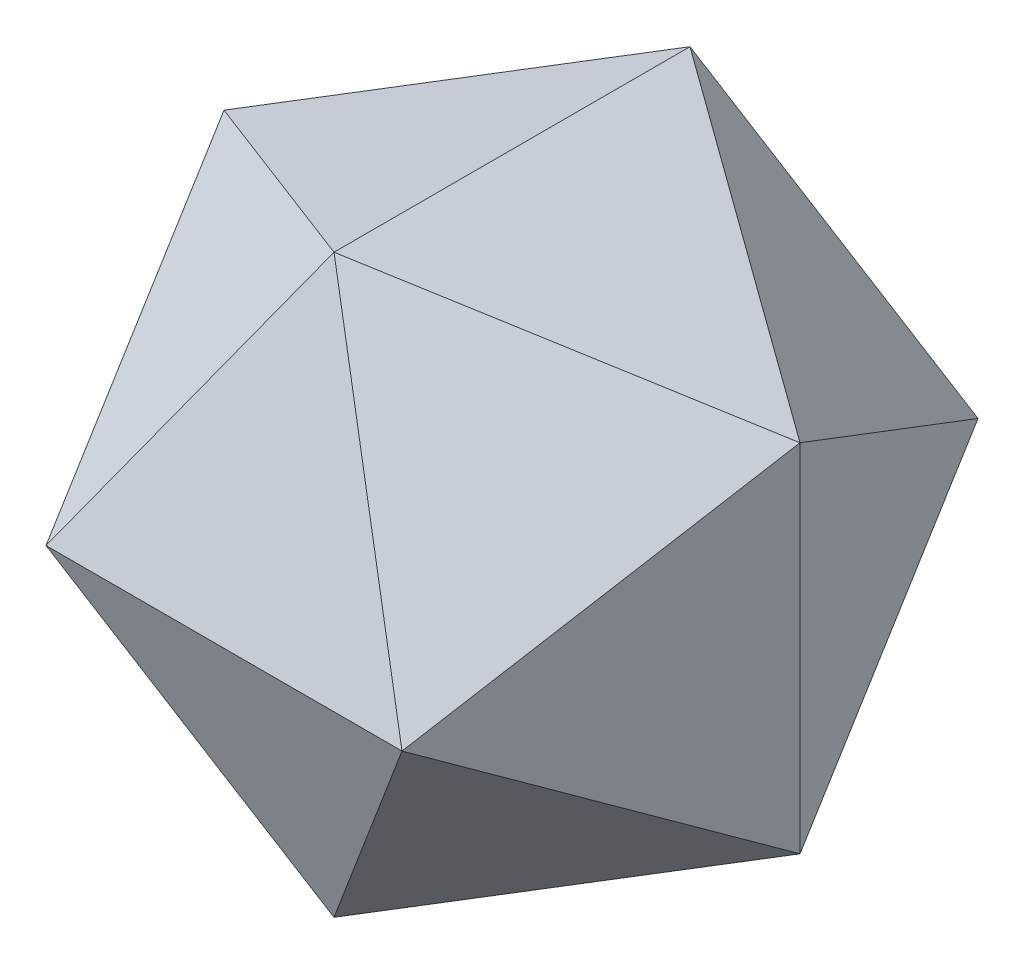
ISO-10303-21;
HEADER;
FILE_DESCRIPTION(('STEP AP214'),'2;1');
FILE_NAME('part.step','',(''),(''),'','','');
FILE_SCHEMA(('AUTOMOTIVE_DESIGN { 1 0 10303 214 1 1 1 1 }'));
ENDSEC;
DATA;
#1=APPLICATION_CONTEXT('core data for automotive mechanical design processes');
#2=APPLICATION_PROTOCOL_DEFINITION('international standard','automotive_design',2000,#1);
#3=PRODUCT_CONTEXT('',#1,'mechanical');
#4=PRODUCT('Part','Part','',(#3));
#5=PRODUCT_RELATED_PRODUCT_CATEGORY('part','',(#4));
#6=PRODUCT_DEFINITION_FORMATION('','',#4);
#7=PRODUCT_DEFINITION_CONTEXT('part definition',#1,'design');
#8=PRODUCT_DEFINITION('design','',#6,#7);
#9=PRODUCT_DEFINITION_SHAPE('','',#8);
#10=(LENGTH_UNIT() NAMED_UNIT(*) SI_UNIT(.MILLI.,.METRE.));
#11=(NAMED_UNIT(*) PLANE_ANGLE_UNIT() SI_UNIT($,.RADIAN.));
#12=(NAMED_UNIT(*) SI_UNIT($,.STERADIAN.) SOLID_ANGLE_UNIT());
#13=UNCERTAINTY_MEASURE_WITH_UNIT(LENGTH_MEASURE(1.E-05),#10,'distance_accuracy_value','');
#14=(GEOMETRIC_REPRESENTATION_CONTEXT(3) GLOBAL_UNCERTAINTY_ASSIGNED_CONTEXT((#13)) GLOBAL_UNIT_ASSIGNED_CONTEXT((#10,
#11,#12)) REPRESENTATION_CONTEXT('',''));
#15=CARTESIAN_POINT('',(0.,0.,0.));
#16=DIRECTION('',(0.,0.,1.));
#17=DIRECTION('',(1.,0.,0.));
#18=AXIS2_PLACEMENT_3D('',#15,#16,#17);
#19=CARTESIAN_POINT('',(-22.1660211047491,22.1660211047491,-22.1660211047491));
#20=DIRECTION('',(-0.577350269189626,0.577350269189626,-0.577350269189626));
#21=DIRECTION('',(-0.707106781186547,-0.707106781186548,0.));
#22=AXIS2_PLACEMENT_3D('',#19,#20,#21);
#23=PLANE('',#22);
#24=DIRECTION('',(-0.809016994374947,-0.309016994374948,0.5));
#25=VECTOR('',#24,1.);
#26=CARTESIAN_POINT('',(0.,41.0980633142473,-25.4));
#27=LINE('',#26,#25);
#28=CARTESIAN_POINT('',(0.,41.0980633142473,-25.4));
#29=VERTEX_POINT('',#28);
#30=CARTESIAN_POINT('',(-41.0980633142473,25.4,0.));
#31=VERTEX_POINT('',#30);
#32=EDGE_CURVE('E133',#29,#31,#27,.T.);
#33=ORIENTED_EDGE('',*,*,#32,.F.);
#34=DIRECTION('',(-0.499999999999999,-0.809016994374948,-0.309016994374948));
#35=VECTOR('',#34,1.);
#36=CARTESIAN_POINT('',(0.,41.0980633142474,-25.4));
#37=LINE('',#36,#35);
#38=CARTESIAN_POINT('',(-25.4,0.,-41.0980633142473));
#39=VERTEX_POINT('',#38);
#40=EDGE_CURVE('E234',#29,#39,#37,.T.);
#41=ORIENTED_EDGE('',*,*,#40,.T.);
#42=DIRECTION('',(0.309016994374948,-0.5,-0.809016994374948));
#43=VECTOR('',#42,1.);
#44=CARTESIAN_POINT('',(-25.4,0.,-41.0980633142473));
#45=LINE('',#44,#43);
#46=EDGE_CURVE('E236',#31,#39,#45,.T.);
#47=ORIENTED_EDGE('',*,*,#46,.F.);
#48=EDGE_LOOP('',(#33,#41,#47));
#49=FACE_BOUND('',#48,.T.);
#50=ADVANCED_FACE('F38',(#49),#23,.T.);
#51=CARTESIAN_POINT('',(-13.6993544380825,35.8653755428315,0.));
#52=DIRECTION('',(-0.356822089773091,0.934172358962715,0.));
#53=DIRECTION('',(-0.934172358962715,-0.356822089773091,0.));
#54=AXIS2_PLACEMENT_3D('',#51,#52,#53);
#55=PLANE('',#54);
#56=ORIENTED_EDGE('',*,*,#32,.T.);
#57=DIRECTION('',(0.809016994374947,0.309016994374948,0.5));
#58=VECTOR('',#57,1.);
#59=CARTESIAN_POINT('',(-41.0980633142473,25.4,0.));
#60=LINE('',#59,#58);
#61=CARTESIAN_POINT('',(0.,41.0980633142473,25.4));
#62=VERTEX_POINT('',#61);
#63=EDGE_CURVE('E246',#31,#62,#60,.T.);
#64=ORIENTED_EDGE('',*,*,#63,.T.);
#65=DIRECTION('',(0.,0.,-1.));
#66=VECTOR('',#65,1.);
#67=CARTESIAN_POINT('',(0.,41.0980633142473,-25.4));
#68=LINE('',#67,#66);
#69=EDGE_CURVE('E239',#62,#29,#68,.T.);
#70=ORIENTED_EDGE('',*,*,#69,.T.);
#71=EDGE_LOOP('',(#56,#64,#70));
#72=FACE_BOUND('',#71,.T.);
#73=ADVANCED_FACE('F344',(#72),#55,.T.);
#74=CARTESIAN_POINT('',(0.,13.6993544380825,-35.8653755428316));
#75=DIRECTION('',(0.,-0.35682208977309,0.934172358962715));
#76=DIRECTION('',(0.,-0.934172358962716,-0.35682208977309));
#77=AXIS2_PLACEMENT_3D('',#74,#75,#76);
#78=PLANE('',#77);
#79=DIRECTION('',(0.499999999999999,-0.809016994374948,-0.309016994374948));
#80=VECTOR('',#79,1.);
#81=CARTESIAN_POINT('',(25.4,0.,-41.0980633142473));
#82=LINE('',#81,#80);
#83=CARTESIAN_POINT('',(25.4,0.,-41.0980633142473));
#84=VERTEX_POINT('',#83);
#85=EDGE_CURVE('E242',#29,#84,#82,.T.);
#86=ORIENTED_EDGE('',*,*,#85,.T.);
#87=DIRECTION('',(1.,0.,0.));
#88=VECTOR('',#87,1.);
#89=CARTESIAN_POINT('',(-25.4,0.,-41.0980633142474));
#90=LINE('',#89,#88);
#91=EDGE_CURVE('E253',#39,#84,#90,.T.);
#92=ORIENTED_EDGE('',*,*,#91,.F.);
#93=ORIENTED_EDGE('',*,*,#40,.F.);
#94=EDGE_LOOP('',(#86,#92,#93));
#95=FACE_BOUND('',#94,.T.);
#96=ADVANCED_FACE('F335',(#95),#78,.F.);
#97=CARTESIAN_POINT('',(-35.8653755428316,0.,-13.6993544380824));
#98=DIRECTION('',(0.934172358962716,0.,0.35682208977309));
#99=DIRECTION('',(0.35682208977309,0.,-0.934172358962716));
#100=AXIS2_PLACEMENT_3D('',#97,#98,#99);
#101=PLANE('',#100);
#102=DIRECTION('',(0.,-1.,0.));
#103=VECTOR('',#102,1.);
#104=CARTESIAN_POINT('',(-41.0980633142473,25.4,0.));
#105=LINE('',#104,#103);
#106=CARTESIAN_POINT('',(-41.0980633142473,-25.4,0.));
#107=VERTEX_POINT('',#106);
#108=EDGE_CURVE('E249',#31,#107,#105,.T.);
#109=ORIENTED_EDGE('',*,*,#108,.F.);
#110=ORIENTED_EDGE('',*,*,#46,.T.);
#111=DIRECTION('',(0.309016994374947,0.5,-0.809016994374948));
#112=VECTOR('',#111,1.);
#113=CARTESIAN_POINT('',(-41.0980633142473,-25.4,0.));
#114=LINE('',#113,#112);
#115=EDGE_CURVE('E258',#107,#39,#114,.T.);
#116=ORIENTED_EDGE('',*,*,#115,.F.);
#117=EDGE_LOOP('',(#109,#110,#116));
#118=FACE_BOUND('',#117,.T.);
#119=ADVANCED_FACE('F340',(#118),#101,.F.);
#120=CARTESIAN_POINT('',(13.6993544380825,35.8653755428315,0.));
#121=DIRECTION('',(-0.35682208977309,-0.934172358962715,0.));
#122=DIRECTION('',(0.934172358962716,-0.35682208977309,0.));
#123=AXIS2_PLACEMENT_3D('',#120,#121,#122);
#124=PLANE('',#123);
#125=DIRECTION('',(-0.809016994374947,0.309016994374948,-0.5));
#126=VECTOR('',#125,1.);
#127=CARTESIAN_POINT('',(0.,41.0980633142474,-25.4));
#128=LINE('',#127,#126);
#129=CARTESIAN_POINT('',(41.0980633142473,25.4,0.));
#130=VERTEX_POINT('',#129);
#131=EDGE_CURVE('E243',#130,#29,#128,.T.);
#132=ORIENTED_EDGE('',*,*,#131,.T.);
#133=ORIENTED_EDGE('',*,*,#69,.F.);
#134=DIRECTION('',(-0.809016994374947,0.309016994374948,0.5));
#135=VECTOR('',#134,1.);
#136=CARTESIAN_POINT('',(41.0980633142473,25.4,0.));
#137=LINE('',#136,#135);
#138=EDGE_CURVE('E262',#130,#62,#137,.T.);
#139=ORIENTED_EDGE('',*,*,#138,.F.);
#140=EDGE_LOOP('',(#132,#133,#139));
#141=FACE_BOUND('',#140,.T.);
#142=ADVANCED_FACE('F347',(#141),#124,.F.);
#143=CARTESIAN_POINT('',(22.1660211047491,22.1660211047491,-22.1660211047491));
#144=DIRECTION('',(0.577350269189626,0.577350269189626,-0.577350269189626));
#145=DIRECTION('',(-0.707106781186547,0.,-0.707106781186548));
#146=AXIS2_PLACEMENT_3D('',#143,#144,#145);
#147=PLANE('',#146);
#148=ORIENTED_EDGE('',*,*,#85,.F.);
#149=ORIENTED_EDGE('',*,*,#131,.F.);
#150=DIRECTION('',(0.309016994374948,0.5,0.809016994374947));
#151=VECTOR('',#150,1.);
#152=CARTESIAN_POINT('',(25.4,0.,-41.0980633142473));
#153=LINE('',#152,#151);
#154=EDGE_CURVE('E267',#84,#130,#153,.T.);
#155=ORIENTED_EDGE('',*,*,#154,.F.);
#156=EDGE_LOOP('',(#148,#149,#155));
#157=FACE_BOUND('',#156,.T.);
#158=ADVANCED_FACE('F372',(#157),#147,.T.);
#159=CARTESIAN_POINT('',(-22.1660211047491,22.1660211047491,22.1660211047491));
#160=DIRECTION('',(0.577350269189626,-0.577350269189626,-0.577350269189625));
#161=DIRECTION('',(0.707106781186548,0.707106781186547,0.));
#162=AXIS2_PLACEMENT_3D('',#159,#160,#161);
#163=PLANE('',#162);
#164=DIRECTION('',(0.5,0.809016994374947,-0.309016994374948));
#165=VECTOR('',#164,1.);
#166=CARTESIAN_POINT('',(0.,41.0980633142473,25.4));
#167=LINE('',#166,#165);
#168=CARTESIAN_POINT('',(-25.4,0.,41.0980633142473));
#169=VERTEX_POINT('',#168);
#170=EDGE_CURVE('E270',#169,#62,#167,.T.);
#171=ORIENTED_EDGE('',*,*,#170,.T.);
#172=ORIENTED_EDGE('',*,*,#63,.F.);
#173=DIRECTION('',(-0.309016994374947,0.5,-0.809016994374948));
#174=VECTOR('',#173,1.);
#175=CARTESIAN_POINT('',(-25.4,0.,41.0980633142473));
#176=LINE('',#175,#174);
#177=EDGE_CURVE('E250',#169,#31,#176,.T.);
#178=ORIENTED_EDGE('',*,*,#177,.F.);
#179=EDGE_LOOP('',(#171,#172,#178));
#180=FACE_BOUND('',#179,.T.);
#181=ADVANCED_FACE('F354',(#180),#163,.F.);
#182=CARTESIAN_POINT('',(-35.8653755428316,0.,13.6993544380824));
#183=DIRECTION('',(-0.934172358962716,0.,0.356822089773089));
#184=DIRECTION('',(0.356822089773089,0.,0.934172358962716));
#185=AXIS2_PLACEMENT_3D('',#182,#183,#184);
#186=PLANE('',#185);
#187=ORIENTED_EDGE('',*,*,#108,.T.);
#188=DIRECTION('',(0.309016994374947,0.5,0.809016994374948));
#189=VECTOR('',#188,1.);
#190=CARTESIAN_POINT('',(-41.0980633142473,-25.4,0.));
#191=LINE('',#190,#189);
#192=EDGE_CURVE('E273',#107,#169,#191,.T.);
#193=ORIENTED_EDGE('',*,*,#192,.T.);
#194=ORIENTED_EDGE('',*,*,#177,.T.);
#195=EDGE_LOOP('',(#187,#193,#194));
#196=FACE_BOUND('',#195,.T.);
#197=ADVANCED_FACE('F364',(#196),#186,.T.);
#198=CARTESIAN_POINT('',(0.,-13.6993544380825,-35.8653755428316));
#199=DIRECTION('',(0.,-0.35682208977309,-0.934172358962715));
#200=DIRECTION('',(0.,0.934172358962716,-0.35682208977309));
#201=AXIS2_PLACEMENT_3D('',#198,#199,#200);
#202=PLANE('',#201);
#203=DIRECTION('',(0.5,-0.809016994374948,0.309016994374948));
#204=VECTOR('',#203,1.);
#205=CARTESIAN_POINT('',(-25.4,0.,-41.0980633142473));
#206=LINE('',#205,#204);
#207=CARTESIAN_POINT('',(0.,-41.0980633142473,-25.4));
#208=VERTEX_POINT('',#207);
#209=EDGE_CURVE('E259',#39,#208,#206,.T.);
#210=ORIENTED_EDGE('',*,*,#209,.F.);
#211=ORIENTED_EDGE('',*,*,#91,.T.);
#212=DIRECTION('',(0.5,0.809016994374947,-0.309016994374948));
#213=VECTOR('',#212,1.);
#214=CARTESIAN_POINT('',(25.4,0.,-41.0980633142473));
#215=LINE('',#214,#213);
#216=EDGE_CURVE('E279',#208,#84,#215,.T.);
#217=ORIENTED_EDGE('',*,*,#216,.F.);
#218=EDGE_LOOP('',(#210,#211,#217));
#219=FACE_BOUND('',#218,.T.);
#220=ADVANCED_FACE('F331',(#219),#202,.T.);
#221=CARTESIAN_POINT('',(-22.1660211047491,-22.1660211047491,-22.1660211047491));
#222=DIRECTION('',(-0.577350269189626,-0.577350269189626,-0.577350269189626));
#223=DIRECTION('',(0.707106781186547,-0.707106781186548,0.));
#224=AXIS2_PLACEMENT_3D('',#221,#222,#223);
#225=PLANE('',#224);
#226=ORIENTED_EDGE('',*,*,#115,.T.);
#227=ORIENTED_EDGE('',*,*,#209,.T.);
#228=DIRECTION('',(0.809016994374947,-0.309016994374948,-0.5));
#229=VECTOR('',#228,1.);
#230=CARTESIAN_POINT('',(-41.0980633142473,-25.4,0.));
#231=LINE('',#230,#229);
#232=EDGE_CURVE('E284',#107,#208,#231,.T.);
#233=ORIENTED_EDGE('',*,*,#232,.F.);
#234=EDGE_LOOP('',(#226,#227,#233));
#235=FACE_BOUND('',#234,.T.);
#236=ADVANCED_FACE('F328',(#235),#225,.T.);
#237=CARTESIAN_POINT('',(22.1660211047491,22.1660211047491,22.1660211047491));
#238=DIRECTION('',(0.577350269189626,0.577350269189626,0.577350269189626));
#239=DIRECTION('',(0.707106781186547,0.,-0.707106781186548));
#240=AXIS2_PLACEMENT_3D('',#237,#238,#239);
#241=PLANE('',#240);
#242=ORIENTED_EDGE('',*,*,#138,.T.);
#243=DIRECTION('',(0.5,-0.809016994374948,0.309016994374948));
#244=VECTOR('',#243,1.);
#245=CARTESIAN_POINT('',(0.,41.0980633142473,25.4));
#246=LINE('',#245,#244);
#247=CARTESIAN_POINT('',(25.4,0.,41.0980633142473));
#248=VERTEX_POINT('',#247);
#249=EDGE_CURVE('E269',#62,#248,#246,.T.);
#250=ORIENTED_EDGE('',*,*,#249,.T.);
#251=DIRECTION('',(-0.309016994374948,-0.5,0.809016994374948));
#252=VECTOR('',#251,1.);
#253=CARTESIAN_POINT('',(41.0980633142473,25.4,0.));
#254=LINE('',#253,#252);
#255=EDGE_CURVE('E287',#130,#248,#254,.T.);
#256=ORIENTED_EDGE('',*,*,#255,.F.);
#257=EDGE_LOOP('',(#242,#250,#256));
#258=FACE_BOUND('',#257,.T.);
#259=ADVANCED_FACE('F350',(#258),#241,.T.);
#260=CARTESIAN_POINT('',(35.8653755428316,0.,-13.6993544380824));
#261=DIRECTION('',(0.934172358962716,0.,-0.35682208977309));
#262=DIRECTION('',(-0.35682208977309,0.,-0.934172358962716));
#263=AXIS2_PLACEMENT_3D('',#260,#261,#262);
#264=PLANE('',#263);
#265=DIRECTION('',(0.309016994374947,-0.5,0.809016994374947));
#266=VECTOR('',#265,1.);
#267=CARTESIAN_POINT('',(25.4,0.,-41.0980633142473));
#268=LINE('',#267,#266);
#269=CARTESIAN_POINT('',(41.0980633142473,-25.4,0.));
#270=VERTEX_POINT('',#269);
#271=EDGE_CURVE('E278',#84,#270,#268,.T.);
#272=ORIENTED_EDGE('',*,*,#271,.F.);
#273=ORIENTED_EDGE('',*,*,#154,.T.);
#274=DIRECTION('',(0.,1.,0.));
#275=VECTOR('',#274,1.);
#276=CARTESIAN_POINT('',(41.0980633142473,25.4,0.));
#277=LINE('',#276,#275);
#278=EDGE_CURVE('E57',#270,#130,#277,.T.);
#279=ORIENTED_EDGE('',*,*,#278,.F.);
#280=EDGE_LOOP('',(#272,#273,#279));
#281=FACE_BOUND('',#280,.T.);
#282=ADVANCED_FACE('F394',(#281),#264,.T.);
#283=CARTESIAN_POINT('',(0.,13.6993544380825,35.8653755428316));
#284=DIRECTION('',(0.,-0.35682208977309,-0.934172358962716));
#285=DIRECTION('',(0.,0.934172358962715,-0.35682208977309));
#286=AXIS2_PLACEMENT_3D('',#283,#284,#285);
#287=PLANE('',#286);
#288=ORIENTED_EDGE('',*,*,#249,.F.);
#289=ORIENTED_EDGE('',*,*,#170,.F.);
#290=DIRECTION('',(1.,0.,0.));
#291=VECTOR('',#290,1.);
#292=CARTESIAN_POINT('',(25.4,0.,41.0980633142473));
#293=LINE('',#292,#291);
#294=EDGE_CURVE('E291',#169,#248,#293,.T.);
#295=ORIENTED_EDGE('',*,*,#294,.T.);
#296=EDGE_LOOP('',(#288,#289,#295));
#297=FACE_BOUND('',#296,.T.);
#298=ADVANCED_FACE('F356',(#297),#287,.F.);
#299=CARTESIAN_POINT('',(-22.1660211047491,-22.1660211047491,22.1660211047491));
#300=DIRECTION('',(0.577350269189626,0.577350269189626,-0.577350269189626));
#301=DIRECTION('',(-0.707106781186547,0.707106781186548,0.));
#302=AXIS2_PLACEMENT_3D('',#299,#300,#301);
#303=PLANE('',#302);
#304=ORIENTED_EDGE('',*,*,#192,.F.);
#305=DIRECTION('',(-0.809016994374947,0.309016994374948,-0.5));
#306=VECTOR('',#305,1.);
#307=CARTESIAN_POINT('',(0.,-41.0980633142473,25.4));
#308=LINE('',#307,#306);
#309=CARTESIAN_POINT('',(0.,-41.0980633142473,25.4));
#310=VERTEX_POINT('',#309);
#311=EDGE_CURVE('E282',#310,#107,#308,.T.);
#312=ORIENTED_EDGE('',*,*,#311,.F.);
#313=DIRECTION('',(-0.5,0.809016994374948,0.309016994374947));
#314=VECTOR('',#313,1.);
#315=CARTESIAN_POINT('',(-25.4,0.,41.0980633142473));
#316=LINE('',#315,#314);
#317=EDGE_CURVE('E294',#310,#169,#316,.T.);
#318=ORIENTED_EDGE('',*,*,#317,.T.);
#319=EDGE_LOOP('',(#304,#312,#318));
#320=FACE_BOUND('',#319,.T.);
#321=ADVANCED_FACE('F362',(#320),#303,.F.);
#322=CARTESIAN_POINT('',(22.1660211047491,-22.1660211047491,-22.1660211047491));
#323=DIRECTION('',(0.577350269189626,-0.577350269189626,-0.577350269189626));
#324=DIRECTION('',(0.,0.707106781186547,-0.707106781186548));
#325=AXIS2_PLACEMENT_3D('',#322,#323,#324);
#326=PLANE('',#325);
#327=ORIENTED_EDGE('',*,*,#271,.T.);
#328=DIRECTION('',(-0.809016994374947,-0.309016994374948,-0.5));
#329=VECTOR('',#328,1.);
#330=CARTESIAN_POINT('',(41.0980633142473,-25.4,0.));
#331=LINE('',#330,#329);
#332=EDGE_CURVE('E297',#270,#208,#331,.T.);
#333=ORIENTED_EDGE('',*,*,#332,.T.);
#334=ORIENTED_EDGE('',*,*,#216,.T.);
#335=EDGE_LOOP('',(#327,#333,#334));
#336=FACE_BOUND('',#335,.T.);
#337=ADVANCED_FACE('F322',(#336),#326,.T.);
#338=CARTESIAN_POINT('',(-13.6993544380825,-35.8653755428315,0.));
#339=DIRECTION('',(-0.35682208977309,-0.934172358962715,0.));
#340=DIRECTION('',(0.934172358962716,-0.35682208977309,0.));
#341=AXIS2_PLACEMENT_3D('',#338,#339,#340);
#342=PLANE('',#341);
#343=ORIENTED_EDGE('',*,*,#311,.T.);
#344=ORIENTED_EDGE('',*,*,#232,.T.);
#345=DIRECTION('',(0.,0.,1.));
#346=VECTOR('',#345,1.);
#347=CARTESIAN_POINT('',(0.,-41.0980633142473,-25.4));
#348=LINE('',#347,#346);
#349=EDGE_CURVE('E300',#208,#310,#348,.T.);
#350=ORIENTED_EDGE('',*,*,#349,.T.);
#351=EDGE_LOOP('',(#343,#344,#350));
#352=FACE_BOUND('',#351,.T.);
#353=ADVANCED_FACE('F325',(#352),#342,.T.);
#354=CARTESIAN_POINT('',(35.8653755428315,0.,13.6993544380824));
#355=DIRECTION('',(0.934172358962716,0.,0.35682208977309));
#356=DIRECTION('',(0.35682208977309,0.,-0.934172358962716));
#357=AXIS2_PLACEMENT_3D('',#354,#355,#356);
#358=PLANE('',#357);
#359=ORIENTED_EDGE('',*,*,#255,.T.);
#360=DIRECTION('',(-0.309016994374947,0.5,0.809016994374948));
#361=VECTOR('',#360,1.);
#362=CARTESIAN_POINT('',(25.4,0.,41.0980633142473));
#363=LINE('',#362,#361);
#364=EDGE_CURVE('E303',#270,#248,#363,.T.);
#365=ORIENTED_EDGE('',*,*,#364,.F.);
#366=ORIENTED_EDGE('',*,*,#278,.T.);
#367=EDGE_LOOP('',(#359,#365,#366));
#368=FACE_BOUND('',#367,.T.);
#369=ADVANCED_FACE('F316',(#368),#358,.T.);
#370=CARTESIAN_POINT('',(0.,-13.6993544380824,35.8653755428316));
#371=DIRECTION('',(0.,-0.35682208977309,0.934172358962716));
#372=DIRECTION('',(0.,-0.934172358962716,-0.35682208977309));
#373=AXIS2_PLACEMENT_3D('',#370,#371,#372);
#374=PLANE('',#373);
#375=ORIENTED_EDGE('',*,*,#294,.F.);
#376=ORIENTED_EDGE('',*,*,#317,.F.);
#377=DIRECTION('',(-0.5,-0.809016994374948,-0.309016994374947));
#378=VECTOR('',#377,1.);
#379=CARTESIAN_POINT('',(25.4,0.,41.0980633142473));
#380=LINE('',#379,#378);
#381=EDGE_CURVE('E48',#248,#310,#380,.T.);
#382=ORIENTED_EDGE('',*,*,#381,.F.);
#383=EDGE_LOOP('',(#375,#376,#382));
#384=FACE_BOUND('',#383,.T.);
#385=ADVANCED_FACE('F359',(#384),#374,.T.);
#386=CARTESIAN_POINT('',(13.6993544380825,-35.8653755428315,0.));
#387=DIRECTION('',(-0.35682208977309,0.934172358962715,0.));
#388=DIRECTION('',(-0.934172358962716,-0.35682208977309,0.));
#389=AXIS2_PLACEMENT_3D('',#386,#387,#388);
#390=PLANE('',#389);
#391=ORIENTED_EDGE('',*,*,#332,.F.);
#392=DIRECTION('',(0.809016994374947,0.309016994374947,-0.5));
#393=VECTOR('',#392,1.);
#394=CARTESIAN_POINT('',(41.0980633142473,-25.4,0.));
#395=LINE('',#394,#393);
#396=EDGE_CURVE('E11',#310,#270,#395,.T.);
#397=ORIENTED_EDGE('',*,*,#396,.F.);
#398=ORIENTED_EDGE('',*,*,#349,.F.);
#399=EDGE_LOOP('',(#391,#397,#398));
#400=FACE_BOUND('',#399,.T.);
#401=ADVANCED_FACE('F320',(#400),#390,.F.);
#402=CARTESIAN_POINT('',(22.1660211047491,-22.1660211047491,22.1660211047491));
#403=DIRECTION('',(-0.577350269189626,0.577350269189626,-0.577350269189626));
#404=DIRECTION('',(-0.707106781186547,-0.707106781186548,0.));
#405=AXIS2_PLACEMENT_3D('',#402,#403,#404);
#406=PLANE('',#405);
#407=ORIENTED_EDGE('',*,*,#364,.T.);
#408=ORIENTED_EDGE('',*,*,#381,.T.);
#409=ORIENTED_EDGE('',*,*,#396,.T.);
#410=EDGE_LOOP('',(#407,#408,#409));
#411=FACE_BOUND('',#410,.T.);
#412=ADVANCED_FACE('F311',(#411),#406,.F.);
#413=CLOSED_SHELL('',(#50,#73,#96,#119,#142,#158,#181,#197,#220,#236,#259,#282,#298,#321,#337,
#353,#369,#385,#401,#412));
#414=CARTESIAN_POINT('',(-19.9663165791366,19.9663165791366,-19.9663165791366));
#415=DIRECTION('',(-0.577350269189626,0.577350269189626,-0.577350269189626));
#416=DIRECTION('',(-0.707106781186547,-0.707106781186548,0.));
#417=AXIS2_PLACEMENT_3D('',#414,#415,#416);
#418=PLANE('',#417);
#419=DIRECTION('',(-0.809016994374947,-0.309016994374948,0.5));
#420=VECTOR('',#419,1.);
#421=CARTESIAN_POINT('',(-18.5097934140705,29.9494748687049,-11.4396814546345));
#422=LINE('',#421,#420);
#423=CARTESIAN_POINT('',(0.,37.0195868281409,-22.879362909269));
#424=VERTEX_POINT('',#423);
#425=CARTESIAN_POINT('',(-37.0195868281409,22.879362909269,0.));
#426=VERTEX_POINT('',#425);
#427=EDGE_CURVE('E229',#424,#426,#422,.T.);
#428=ORIENTED_EDGE('',*,*,#427,.T.);
#429=DIRECTION('',(0.309016994374948,-0.5,-0.809016994374947));
#430=VECTOR('',#429,1.);
#431=CARTESIAN_POINT('',(-29.949474868705,11.4396814546345,-18.5097934140705));
#432=LINE('',#431,#430);
#433=CARTESIAN_POINT('',(-22.879362909269,0.,-37.0195868281409));
#434=VERTEX_POINT('',#433);
#435=EDGE_CURVE('E221',#426,#434,#432,.T.);
#436=ORIENTED_EDGE('',*,*,#435,.T.);
#437=DIRECTION('',(-0.5,-0.809016994374948,-0.309016994374948));
#438=VECTOR('',#437,1.);
#439=CARTESIAN_POINT('',(-11.4396814546345,18.5097934140705,-29.949474868705));
#440=LINE('',#439,#438);
#441=EDGE_CURVE('E226',#424,#434,#440,.T.);
#442=ORIENTED_EDGE('',*,*,#441,.F.);
#443=EDGE_LOOP('',(#428,#436,#442));
#444=FACE_BOUND('',#443,.T.);
#445=ADVANCED_FACE('F460',(#444),#418,.F.);
#446=CARTESIAN_POINT('',(-12.339862276047,32.3061788551836,0.));
#447=DIRECTION('',(-0.356822089773091,0.934172358962715,0.));
#448=DIRECTION('',(-0.934172358962715,-0.356822089773091,0.));
#449=AXIS2_PLACEMENT_3D('',#446,#447,#448);
#450=PLANE('',#449);
#451=ORIENTED_EDGE('',*,*,#427,.F.);
#452=DIRECTION('',(0.,0.,-1.));
#453=VECTOR('',#452,1.);
#454=CARTESIAN_POINT('',(0.,37.0195868281409,0.));
#455=LINE('',#454,#453);
#456=CARTESIAN_POINT('',(0.,37.0195868281409,22.879362909269));
#457=VERTEX_POINT('',#456);
#458=EDGE_CURVE('E218',#457,#424,#455,.T.);
#459=ORIENTED_EDGE('',*,*,#458,.F.);
#460=DIRECTION('',(0.809016994374947,0.309016994374948,0.5));
#461=VECTOR('',#460,1.);
#462=CARTESIAN_POINT('',(-18.5097934140705,29.9494748687049,11.4396814546345));
#463=LINE('',#462,#461);
#464=EDGE_CURVE('E203',#426,#457,#463,.T.);
#465=ORIENTED_EDGE('',*,*,#464,.F.);
#466=EDGE_LOOP('',(#451,#459,#465));
#467=FACE_BOUND('',#466,.T.);
#468=ADVANCED_FACE('F466',(#467),#450,.F.);
#469=CARTESIAN_POINT('',(0.,12.339862276047,-32.3061788551836));
#470=DIRECTION('',(0.,-0.35682208977309,0.934172358962715));
#471=DIRECTION('',(0.,-0.934172358962716,-0.35682208977309));
#472=AXIS2_PLACEMENT_3D('',#469,#470,#471);
#473=PLANE('',#472);
#474=DIRECTION('',(0.499999999999999,-0.809016994374947,-0.309016994374948));
#475=VECTOR('',#474,1.);
#476=CARTESIAN_POINT('',(11.4396814546345,18.5097934140705,-29.949474868705));
#477=LINE('',#476,#475);
#478=CARTESIAN_POINT('',(22.879362909269,0.,-37.0195868281409));
#479=VERTEX_POINT('',#478);
#480=EDGE_CURVE('E204',#424,#479,#477,.T.);
#481=ORIENTED_EDGE('',*,*,#480,.F.);
#482=ORIENTED_EDGE('',*,*,#441,.T.);
#483=DIRECTION('',(1.,0.,0.));
#484=VECTOR('',#483,1.);
#485=CARTESIAN_POINT('',(0.,0.,-37.0195868281409));
#486=LINE('',#485,#484);
#487=EDGE_CURVE('E207',#434,#479,#486,.T.);
#488=ORIENTED_EDGE('',*,*,#487,.T.);
#489=EDGE_LOOP('',(#481,#482,#488));
#490=FACE_BOUND('',#489,.T.);
#491=ADVANCED_FACE('F478',(#490),#473,.T.);
#492=CARTESIAN_POINT('',(-32.3061788551836,0.,-12.339862276047));
#493=DIRECTION('',(0.934172358962716,0.,0.35682208977309));
#494=DIRECTION('',(0.35682208977309,0.,-0.934172358962716));
#495=AXIS2_PLACEMENT_3D('',#492,#493,#494);
#496=PLANE('',#495);
#497=DIRECTION('',(0.,-1.,0.));
#498=VECTOR('',#497,1.);
#499=CARTESIAN_POINT('',(-37.0195868281409,0.,0.));
#500=LINE('',#499,#498);
#501=CARTESIAN_POINT('',(-37.0195868281409,-22.879362909269,0.));
#502=VERTEX_POINT('',#501);
#503=EDGE_CURVE('E208',#426,#502,#500,.T.);
#504=ORIENTED_EDGE('',*,*,#503,.T.);
#505=DIRECTION('',(0.309016994374948,0.5,-0.809016994374948));
#506=VECTOR('',#505,1.);
#507=CARTESIAN_POINT('',(-29.949474868705,-11.4396814546345,-18.5097934140705));
#508=LINE('',#507,#506);
#509=EDGE_CURVE('E197',#502,#434,#508,.T.);
#510=ORIENTED_EDGE('',*,*,#509,.T.);
#511=ORIENTED_EDGE('',*,*,#435,.F.);
#512=EDGE_LOOP('',(#504,#510,#511));
#513=FACE_BOUND('',#512,.T.);
#514=ADVANCED_FACE('F488',(#513),#496,.T.);
#515=CARTESIAN_POINT('',(12.339862276047,32.3061788551836,0.));
#516=DIRECTION('',(-0.35682208977309,-0.934172358962715,0.));
#517=DIRECTION('',(0.934172358962716,-0.35682208977309,0.));
#518=AXIS2_PLACEMENT_3D('',#515,#516,#517);
#519=PLANE('',#518);
#520=DIRECTION('',(-0.809016994374947,0.309016994374948,-0.5));
#521=VECTOR('',#520,1.);
#522=CARTESIAN_POINT('',(18.5097934140705,29.9494748687049,-11.4396814546345));
#523=LINE('',#522,#521);
#524=CARTESIAN_POINT('',(37.0195868281409,22.879362909269,0.));
#525=VERTEX_POINT('',#524);
#526=EDGE_CURVE('E201',#525,#424,#523,.T.);
#527=ORIENTED_EDGE('',*,*,#526,.F.);
#528=DIRECTION('',(-0.809016994374947,0.309016994374948,0.5));
#529=VECTOR('',#528,1.);
#530=CARTESIAN_POINT('',(18.5097934140705,29.9494748687049,11.4396814546345));
#531=LINE('',#530,#529);
#532=EDGE_CURVE('E196',#525,#457,#531,.T.);
#533=ORIENTED_EDGE('',*,*,#532,.T.);
#534=ORIENTED_EDGE('',*,*,#458,.T.);
#535=EDGE_LOOP('',(#527,#533,#534));
#536=FACE_BOUND('',#535,.T.);
#537=ADVANCED_FACE('F498',(#536),#519,.T.);
#538=CARTESIAN_POINT('',(19.9663165791366,19.9663165791366,-19.9663165791366));
#539=DIRECTION('',(0.577350269189626,0.577350269189626,-0.577350269189626));
#540=DIRECTION('',(-0.707106781186547,0.,-0.707106781186548));
#541=AXIS2_PLACEMENT_3D('',#538,#539,#540);
#542=PLANE('',#541);
#543=ORIENTED_EDGE('',*,*,#480,.T.);
#544=DIRECTION('',(0.309016994374948,0.5,0.809016994374947));
#545=VECTOR('',#544,1.);
#546=CARTESIAN_POINT('',(29.949474868705,11.4396814546345,-18.5097934140704));
#547=LINE('',#546,#545);
#548=EDGE_CURVE('E179',#479,#525,#547,.T.);
#549=ORIENTED_EDGE('',*,*,#548,.T.);
#550=ORIENTED_EDGE('',*,*,#526,.T.);
#551=EDGE_LOOP('',(#543,#549,#550));
#552=FACE_BOUND('',#551,.T.);
#553=ADVANCED_FACE('F508',(#552),#542,.F.);
#554=CARTESIAN_POINT('',(-19.9663165791366,19.9663165791366,19.9663165791366));
#555=DIRECTION('',(0.577350269189626,-0.577350269189626,-0.577350269189625));
#556=DIRECTION('',(0.707106781186548,0.707106781186547,0.));
#557=AXIS2_PLACEMENT_3D('',#554,#555,#556);
#558=PLANE('',#557);
#559=DIRECTION('',(0.5,0.809016994374947,-0.309016994374948));
#560=VECTOR('',#559,1.);
#561=CARTESIAN_POINT('',(-11.4396814546345,18.5097934140705,29.949474868705));
#562=LINE('',#561,#560);
#563=CARTESIAN_POINT('',(-22.879362909269,0.,37.0195868281409));
#564=VERTEX_POINT('',#563);
#565=EDGE_CURVE('E186',#564,#457,#562,.T.);
#566=ORIENTED_EDGE('',*,*,#565,.F.);
#567=DIRECTION('',(-0.309016994374947,0.5,-0.809016994374948));
#568=VECTOR('',#567,1.);
#569=CARTESIAN_POINT('',(-29.949474868705,11.4396814546345,18.5097934140704));
#570=LINE('',#569,#568);
#571=EDGE_CURVE('E205',#564,#426,#570,.T.);
#572=ORIENTED_EDGE('',*,*,#571,.T.);
#573=ORIENTED_EDGE('',*,*,#464,.T.);
#574=EDGE_LOOP('',(#566,#572,#573));
#575=FACE_BOUND('',#574,.T.);
#576=ADVANCED_FACE('F518',(#575),#558,.T.);
#577=CARTESIAN_POINT('',(-32.3061788551836,0.,12.339862276047));
#578=DIRECTION('',(-0.934172358962716,0.,0.356822089773089));
#579=DIRECTION('',(0.356822089773089,0.,0.934172358962716));
#580=AXIS2_PLACEMENT_3D('',#577,#578,#579);
#581=PLANE('',#580);
#582=ORIENTED_EDGE('',*,*,#503,.F.);
#583=ORIENTED_EDGE('',*,*,#571,.F.);
#584=DIRECTION('',(0.309016994374947,0.5,0.809016994374947));
#585=VECTOR('',#584,1.);
#586=CARTESIAN_POINT('',(-29.949474868705,-11.4396814546345,18.5097934140704));
#587=LINE('',#586,#585);
#588=EDGE_CURVE('E160',#502,#564,#587,.T.);
#589=ORIENTED_EDGE('',*,*,#588,.F.);
#590=EDGE_LOOP('',(#582,#583,#589));
#591=FACE_BOUND('',#590,.T.);
#592=ADVANCED_FACE('F528',(#591),#581,.F.);
#593=CARTESIAN_POINT('',(0.,-12.339862276047,-32.3061788551836));
#594=DIRECTION('',(0.,-0.35682208977309,-0.934172358962715));
#595=DIRECTION('',(0.,0.934172358962716,-0.35682208977309));
#596=AXIS2_PLACEMENT_3D('',#593,#594,#595);
#597=PLANE('',#596);
#598=DIRECTION('',(0.5,-0.809016994374948,0.309016994374948));
#599=VECTOR('',#598,1.);
#600=CARTESIAN_POINT('',(-11.4396814546345,-18.5097934140705,-29.949474868705));
#601=LINE('',#600,#599);
#602=CARTESIAN_POINT('',(0.,-37.0195868281409,-22.879362909269));
#603=VERTEX_POINT('',#602);
#604=EDGE_CURVE('E193',#434,#603,#601,.T.);
#605=ORIENTED_EDGE('',*,*,#604,.T.);
#606=DIRECTION('',(0.5,0.809016994374947,-0.309016994374948));
#607=VECTOR('',#606,1.);
#608=CARTESIAN_POINT('',(11.4396814546345,-18.5097934140705,-29.9494748687049));
#609=LINE('',#608,#607);
#610=EDGE_CURVE('E157',#603,#479,#609,.T.);
#611=ORIENTED_EDGE('',*,*,#610,.T.);
#612=ORIENTED_EDGE('',*,*,#487,.F.);
#613=EDGE_LOOP('',(#605,#611,#612));
#614=FACE_BOUND('',#613,.T.);
#615=ADVANCED_FACE('F538',(#614),#597,.F.);
#616=CARTESIAN_POINT('',(-19.9663165791366,-19.9663165791366,-19.9663165791366));
#617=DIRECTION('',(-0.577350269189626,-0.577350269189626,-0.577350269189626));
#618=DIRECTION('',(0.707106781186547,-0.707106781186548,0.));
#619=AXIS2_PLACEMENT_3D('',#616,#617,#618);
#620=PLANE('',#619);
#621=ORIENTED_EDGE('',*,*,#509,.F.);
#622=DIRECTION('',(0.809016994374947,-0.309016994374948,-0.5));
#623=VECTOR('',#622,1.);
#624=CARTESIAN_POINT('',(-18.5097934140705,-29.9494748687049,-11.4396814546345));
#625=LINE('',#624,#623);
#626=EDGE_CURVE('E153',#502,#603,#625,.T.);
#627=ORIENTED_EDGE('',*,*,#626,.T.);
#628=ORIENTED_EDGE('',*,*,#604,.F.);
#629=EDGE_LOOP('',(#621,#627,#628));
#630=FACE_BOUND('',#629,.T.);
#631=ADVANCED_FACE('F548',(#630),#620,.F.);
#632=CARTESIAN_POINT('',(19.9663165791366,19.9663165791366,19.9663165791366));
#633=DIRECTION('',(0.577350269189626,0.577350269189626,0.577350269189626));
#634=DIRECTION('',(0.707106781186547,0.,-0.707106781186548));
#635=AXIS2_PLACEMENT_3D('',#632,#633,#634);
#636=PLANE('',#635);
#637=ORIENTED_EDGE('',*,*,#532,.F.);
#638=DIRECTION('',(-0.309016994374948,-0.5,0.809016994374948));
#639=VECTOR('',#638,1.);
#640=CARTESIAN_POINT('',(29.9494748687049,11.4396814546345,18.5097934140704));
#641=LINE('',#640,#639);
#642=CARTESIAN_POINT('',(22.879362909269,0.,37.0195868281409));
#643=VERTEX_POINT('',#642);
#644=EDGE_CURVE('E171',#525,#643,#641,.T.);
#645=ORIENTED_EDGE('',*,*,#644,.T.);
#646=DIRECTION('',(0.499999999999999,-0.809016994374948,0.309016994374948));
#647=VECTOR('',#646,1.);
#648=CARTESIAN_POINT('',(11.4396814546345,18.5097934140705,29.949474868705));
#649=LINE('',#648,#647);
#650=EDGE_CURVE('E190',#457,#643,#649,.T.);
#651=ORIENTED_EDGE('',*,*,#650,.F.);
#652=EDGE_LOOP('',(#637,#645,#651));
#653=FACE_BOUND('',#652,.T.);
#654=ADVANCED_FACE('F558',(#653),#636,.F.);
#655=CARTESIAN_POINT('',(32.3061788551836,0.,-12.339862276047));
#656=DIRECTION('',(0.934172358962716,0.,-0.35682208977309));
#657=DIRECTION('',(-0.35682208977309,0.,-0.934172358962716));
#658=AXIS2_PLACEMENT_3D('',#655,#656,#657);
#659=PLANE('',#658);
#660=DIRECTION('',(0.309016994374947,-0.5,0.809016994374947));
#661=VECTOR('',#660,1.);
#662=CARTESIAN_POINT('',(29.949474868705,-11.4396814546345,-18.5097934140705));
#663=LINE('',#662,#661);
#664=CARTESIAN_POINT('',(37.0195868281409,-22.879362909269,0.));
#665=VERTEX_POINT('',#664);
#666=EDGE_CURVE('E177',#479,#665,#663,.T.);
#667=ORIENTED_EDGE('',*,*,#666,.T.);
#668=DIRECTION('',(0.,1.,0.));
#669=VECTOR('',#668,1.);
#670=CARTESIAN_POINT('',(37.0195868281409,0.,0.));
#671=LINE('',#670,#669);
#672=EDGE_CURVE('E164',#665,#525,#671,.T.);
#673=ORIENTED_EDGE('',*,*,#672,.T.);
#674=ORIENTED_EDGE('',*,*,#548,.F.);
#675=EDGE_LOOP('',(#667,#673,#674));
#676=FACE_BOUND('',#675,.T.);
#677=ADVANCED_FACE('F178',(#676),#659,.F.);
#678=CARTESIAN_POINT('',(0.,12.339862276047,32.3061788551836));
#679=DIRECTION('',(0.,-0.35682208977309,-0.934172358962716));
#680=DIRECTION('',(0.,0.934172358962715,-0.35682208977309));
#681=AXIS2_PLACEMENT_3D('',#678,#679,#680);
#682=PLANE('',#681);
#683=ORIENTED_EDGE('',*,*,#650,.T.);
#684=DIRECTION('',(1.,0.,0.));
#685=VECTOR('',#684,1.);
#686=CARTESIAN_POINT('',(0.,0.,37.0195868281409));
#687=LINE('',#686,#685);
#688=EDGE_CURVE('E140',#564,#643,#687,.T.);
#689=ORIENTED_EDGE('',*,*,#688,.F.);
#690=ORIENTED_EDGE('',*,*,#565,.T.);
#691=EDGE_LOOP('',(#683,#689,#690));
#692=FACE_BOUND('',#691,.T.);
#693=ADVANCED_FACE('F577',(#692),#682,.T.);
#694=CARTESIAN_POINT('',(-19.9663165791367,-19.9663165791366,19.9663165791366));
#695=DIRECTION('',(0.577350269189626,0.577350269189626,-0.577350269189626));
#696=DIRECTION('',(-0.707106781186547,0.707106781186548,0.));
#697=AXIS2_PLACEMENT_3D('',#694,#695,#696);
#698=PLANE('',#697);
#699=ORIENTED_EDGE('',*,*,#588,.T.);
#700=DIRECTION('',(-0.5,0.809016994374947,0.309016994374947));
#701=VECTOR('',#700,1.);
#702=CARTESIAN_POINT('',(-11.4396814546345,-18.5097934140705,29.949474868705));
#703=LINE('',#702,#701);
#704=CARTESIAN_POINT('',(0.,-37.0195868281409,22.879362909269));
#705=VERTEX_POINT('',#704);
#706=EDGE_CURVE('E138',#705,#564,#703,.T.);
#707=ORIENTED_EDGE('',*,*,#706,.F.);
#708=DIRECTION('',(-0.809016994374947,0.309016994374948,-0.5));
#709=VECTOR('',#708,1.);
#710=CARTESIAN_POINT('',(-18.5097934140705,-29.9494748687049,11.4396814546345));
#711=LINE('',#710,#709);
#712=EDGE_CURVE('E151',#705,#502,#711,.T.);
#713=ORIENTED_EDGE('',*,*,#712,.T.);
#714=EDGE_LOOP('',(#699,#707,#713));
#715=FACE_BOUND('',#714,.T.);
#716=ADVANCED_FACE('F159',(#715),#698,.T.);
#717=CARTESIAN_POINT('',(19.9663165791366,-19.9663165791367,-19.9663165791366));
#718=DIRECTION('',(0.577350269189626,-0.577350269189626,-0.577350269189626));
#719=DIRECTION('',(0.,0.707106781186547,-0.707106781186548));
#720=AXIS2_PLACEMENT_3D('',#717,#718,#719);
#721=PLANE('',#720);
#722=ORIENTED_EDGE('',*,*,#666,.F.);
#723=ORIENTED_EDGE('',*,*,#610,.F.);
#724=DIRECTION('',(-0.809016994374948,-0.309016994374948,-0.499999999999999));
#725=VECTOR('',#724,1.);
#726=CARTESIAN_POINT('',(18.5097934140705,-29.9494748687049,-11.4396814546345));
#727=LINE('',#726,#725);
#728=EDGE_CURVE('E146',#665,#603,#727,.T.);
#729=ORIENTED_EDGE('',*,*,#728,.F.);
#730=EDGE_LOOP('',(#722,#723,#729));
#731=FACE_BOUND('',#730,.T.);
#732=ADVANCED_FACE('F595',(#731),#721,.F.);
#733=CARTESIAN_POINT('',(-12.339862276047,-32.3061788551836,0.));
#734=DIRECTION('',(-0.35682208977309,-0.934172358962715,0.));
#735=DIRECTION('',(0.934172358962716,-0.35682208977309,0.));
#736=AXIS2_PLACEMENT_3D('',#733,#734,#735);
#737=PLANE('',#736);
#738=ORIENTED_EDGE('',*,*,#712,.F.);
#739=DIRECTION('',(0.,0.,1.));
#740=VECTOR('',#739,1.);
#741=CARTESIAN_POINT('',(0.,-37.0195868281409,0.));
#742=LINE('',#741,#740);
#743=EDGE_CURVE('E143',#603,#705,#742,.T.);
#744=ORIENTED_EDGE('',*,*,#743,.F.);
#745=ORIENTED_EDGE('',*,*,#626,.F.);
#746=EDGE_LOOP('',(#738,#744,#745));
#747=FACE_BOUND('',#746,.T.);
#748=ADVANCED_FACE('F152',(#747),#737,.F.);
#749=CARTESIAN_POINT('',(32.3061788551836,0.,12.339862276047));
#750=DIRECTION('',(0.934172358962716,0.,0.35682208977309));
#751=DIRECTION('',(0.35682208977309,0.,-0.934172358962716));
#752=AXIS2_PLACEMENT_3D('',#749,#750,#751);
#753=PLANE('',#752);
#754=ORIENTED_EDGE('',*,*,#644,.F.);
#755=ORIENTED_EDGE('',*,*,#672,.F.);
#756=DIRECTION('',(-0.309016994374947,0.5,0.809016994374948));
#757=VECTOR('',#756,1.);
#758=CARTESIAN_POINT('',(29.9494748687049,-11.4396814546345,18.5097934140705));
#759=LINE('',#758,#757);
#760=EDGE_CURVE('E131',#665,#643,#759,.T.);
#761=ORIENTED_EDGE('',*,*,#760,.T.);
#762=EDGE_LOOP('',(#754,#755,#761));
#763=FACE_BOUND('',#762,.T.);
#764=ADVANCED_FACE('F169',(#763),#753,.F.);
#765=CARTESIAN_POINT('',(0.,-12.339862276047,32.3061788551836));
#766=DIRECTION('',(0.,-0.35682208977309,0.934172358962716));
#767=DIRECTION('',(0.,-0.934172358962716,-0.35682208977309));
#768=AXIS2_PLACEMENT_3D('',#765,#766,#767);
#769=PLANE('',#768);
#770=ORIENTED_EDGE('',*,*,#688,.T.);
#771=DIRECTION('',(-0.5,-0.809016994374948,-0.309016994374947));
#772=VECTOR('',#771,1.);
#773=CARTESIAN_POINT('',(11.4396814546345,-18.5097934140705,29.949474868705));
#774=LINE('',#773,#772);
#775=EDGE_CURVE('E129',#643,#705,#774,.T.);
#776=ORIENTED_EDGE('',*,*,#775,.T.);
#777=ORIENTED_EDGE('',*,*,#706,.T.);
#778=EDGE_LOOP('',(#770,#776,#777));
#779=FACE_BOUND('',#778,.T.);
#780=ADVANCED_FACE('F136',(#779),#769,.F.);
#781=CARTESIAN_POINT('',(12.339862276047,-32.3061788551836,0.));
#782=DIRECTION('',(-0.35682208977309,0.934172358962715,0.));
#783=DIRECTION('',(-0.934172358962716,-0.35682208977309,0.));
#784=AXIS2_PLACEMENT_3D('',#781,#782,#783);
#785=PLANE('',#784);
#786=ORIENTED_EDGE('',*,*,#728,.T.);
#787=ORIENTED_EDGE('',*,*,#743,.T.);
#788=DIRECTION('',(0.809016994374947,0.309016994374948,-0.5));
#789=VECTOR('',#788,1.);
#790=CARTESIAN_POINT('',(18.5097934140705,-29.9494748687049,11.4396814546345));
#791=LINE('',#790,#789);
#792=EDGE_CURVE('E42',#705,#665,#791,.T.);
#793=ORIENTED_EDGE('',*,*,#792,.T.);
#794=EDGE_LOOP('',(#786,#787,#793));
#795=FACE_BOUND('',#794,.T.);
#796=ADVANCED_FACE('F145',(#795),#785,.T.);
#797=CARTESIAN_POINT('',(19.9663165791366,-19.9663165791366,19.9663165791366));
#798=DIRECTION('',(-0.577350269189626,0.577350269189626,-0.577350269189626));
#799=DIRECTION('',(-0.707106781186547,-0.707106781186548,0.));
#800=AXIS2_PLACEMENT_3D('',#797,#798,#799);
#801=PLANE('',#800);
#802=ORIENTED_EDGE('',*,*,#760,.F.);
#803=ORIENTED_EDGE('',*,*,#792,.F.);
#804=ORIENTED_EDGE('',*,*,#775,.F.);
#805=EDGE_LOOP('',(#802,#803,#804));
#806=FACE_BOUND('',#805,.T.);
#807=ADVANCED_FACE('F40',(#806),#801,.T.);
#808=CLOSED_SHELL('',(#445,#468,#491,#514,#537,#553,#576,#592,#615,#631,#654,#677,#693,#716,
#732,#748,#764,#780,#796,#807));
#809=ORIENTED_CLOSED_SHELL('',*,#808,.T.);
#810=BREP_WITH_VOIDS('B2',#413,(#809));
#811=ADVANCED_BREP_SHAPE_REPRESENTATION('',(#18,#810),#14);
#812=SHAPE_DEFINITION_REPRESENTATION(#9,#811);
ENDSEC;
END-ISO-10303-21;
